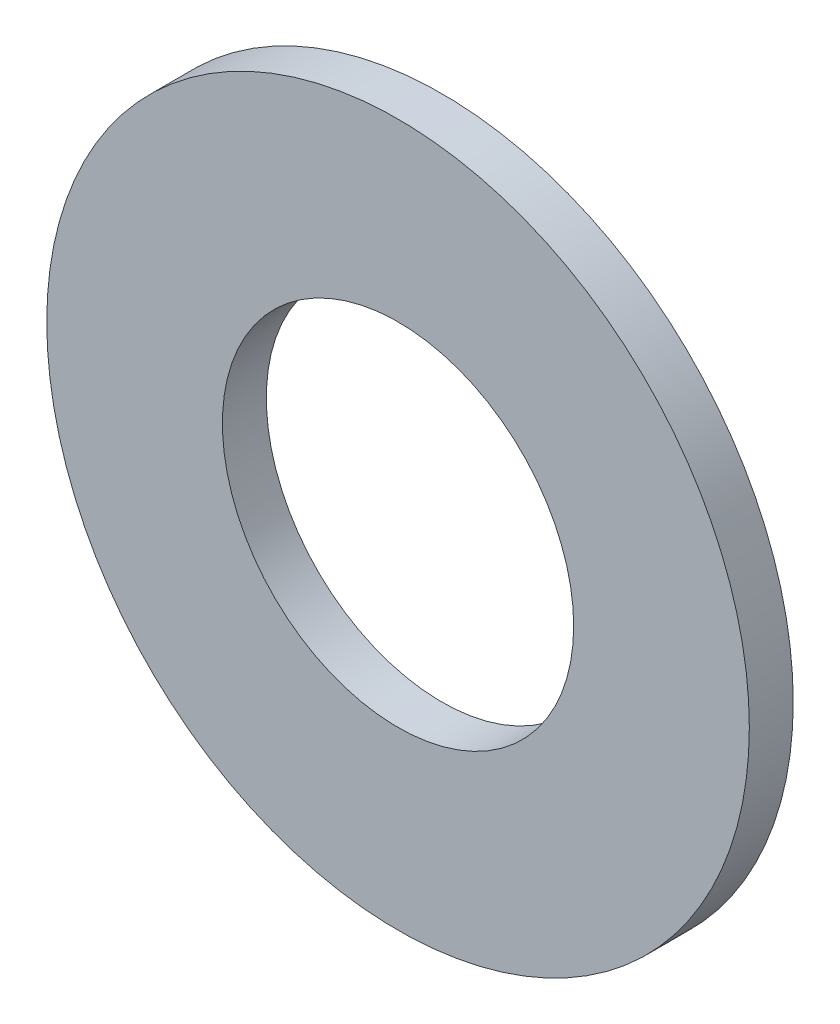
ISO-10303-21;
HEADER;
FILE_DESCRIPTION(('STEP AP214'),'2;1');
FILE_NAME('part.step','',(''),(''),'','','');
FILE_SCHEMA(('AUTOMOTIVE_DESIGN { 1 0 10303 214 1 1 1 1 }'));
ENDSEC;
DATA;
#1=APPLICATION_CONTEXT('core data for automotive mechanical design processes');
#2=APPLICATION_PROTOCOL_DEFINITION('international standard','automotive_design',2000,#1);
#3=PRODUCT_CONTEXT('',#1,'mechanical');
#4=PRODUCT('Part','Part','',(#3));
#5=PRODUCT_RELATED_PRODUCT_CATEGORY('part','',(#4));
#6=PRODUCT_DEFINITION_FORMATION('','',#4);
#7=PRODUCT_DEFINITION_CONTEXT('part definition',#1,'design');
#8=PRODUCT_DEFINITION('design','',#6,#7);
#9=PRODUCT_DEFINITION_SHAPE('','',#8);
#10=(LENGTH_UNIT() NAMED_UNIT(*) SI_UNIT(.MILLI.,.METRE.));
#11=(NAMED_UNIT(*) PLANE_ANGLE_UNIT() SI_UNIT($,.RADIAN.));
#12=(NAMED_UNIT(*) SI_UNIT($,.STERADIAN.) SOLID_ANGLE_UNIT());
#13=UNCERTAINTY_MEASURE_WITH_UNIT(LENGTH_MEASURE(1.E-05),#10,'distance_accuracy_value','');
#14=(GEOMETRIC_REPRESENTATION_CONTEXT(3) GLOBAL_UNCERTAINTY_ASSIGNED_CONTEXT((#13)) GLOBAL_UNIT_ASSIGNED_CONTEXT((#10,
#11,#12)) REPRESENTATION_CONTEXT('',''));
#15=CARTESIAN_POINT('',(0.,0.,0.));
#16=DIRECTION('',(0.,0.,1.));
#17=DIRECTION('',(1.,0.,0.));
#18=AXIS2_PLACEMENT_3D('',#15,#16,#17);
#19=CARTESIAN_POINT('',(0.,0.,1.5));
#20=DIRECTION('',(0.,0.,1.));
#21=DIRECTION('',(1.,0.,0.));
#22=AXIS2_PLACEMENT_3D('',#19,#20,#21);
#23=PLANE('',#22);
#24=CARTESIAN_POINT('',(0.,0.,1.5));
#25=DIRECTION('',(0.,0.,1.));
#26=DIRECTION('',(1.,0.,0.));
#27=AXIS2_PLACEMENT_3D('',#24,#25,#26);
#28=CIRCLE('',#27,12.);
#29=CARTESIAN_POINT('',(12.,0.,1.5));
#30=VERTEX_POINT('',#29);
#31=EDGE_CURVE('E10',#30,#30,#28,.T.);
#32=ORIENTED_EDGE('',*,*,#31,.T.);
#33=EDGE_LOOP('',(#32));
#34=FACE_BOUND('',#33,.T.);
#35=CARTESIAN_POINT('',(0.,0.,1.5));
#36=DIRECTION('',(0.,0.,1.));
#37=DIRECTION('',(1.,0.,0.));
#38=AXIS2_PLACEMENT_3D('',#35,#36,#37);
#39=CIRCLE('',#38,6.);
#40=CARTESIAN_POINT('',(6.,0.,1.5));
#41=VERTEX_POINT('',#40);
#42=EDGE_CURVE('E50',#41,#41,#39,.T.);
#43=ORIENTED_EDGE('',*,*,#42,.F.);
#44=EDGE_LOOP('',(#43));
#45=FACE_BOUND('',#44,.T.);
#46=ADVANCED_FACE('F37',(#34,#45),#23,.T.);
#47=CARTESIAN_POINT('',(0.,0.,0.));
#48=DIRECTION('',(0.,0.,1.));
#49=DIRECTION('',(1.,0.,0.));
#50=AXIS2_PLACEMENT_3D('',#47,#48,#49);
#51=PLANE('',#50);
#52=CARTESIAN_POINT('',(0.,0.,0.));
#53=DIRECTION('',(0.,0.,1.));
#54=DIRECTION('',(1.,0.,0.));
#55=AXIS2_PLACEMENT_3D('',#52,#53,#54);
#56=CIRCLE('',#55,12.);
#57=CARTESIAN_POINT('',(12.,0.,0.));
#58=VERTEX_POINT('',#57);
#59=EDGE_CURVE('E41',#58,#58,#56,.T.);
#60=ORIENTED_EDGE('',*,*,#59,.F.);
#61=EDGE_LOOP('',(#60));
#62=FACE_BOUND('',#61,.T.);
#63=CARTESIAN_POINT('',(0.,0.,0.));
#64=DIRECTION('',(0.,0.,1.));
#65=DIRECTION('',(1.,0.,0.));
#66=AXIS2_PLACEMENT_3D('',#63,#64,#65);
#67=CIRCLE('',#66,6.);
#68=CARTESIAN_POINT('',(6.,0.,0.));
#69=VERTEX_POINT('',#68);
#70=EDGE_CURVE('E52',#69,#69,#67,.T.);
#71=ORIENTED_EDGE('',*,*,#70,.T.);
#72=EDGE_LOOP('',(#71));
#73=FACE_BOUND('',#72,.T.);
#74=ADVANCED_FACE('F64',(#62,#73),#51,.F.);
#75=CARTESIAN_POINT('',(0.,0.,1.5));
#76=DIRECTION('',(0.,0.,-1.));
#77=DIRECTION('',(-1.,0.,0.));
#78=AXIS2_PLACEMENT_3D('',#75,#76,#77);
#79=CYLINDRICAL_SURFACE('',#78,12.);
#80=ORIENTED_EDGE('',*,*,#31,.F.);
#81=EDGE_LOOP('',(#80));
#82=FACE_BOUND('',#81,.T.);
#83=ORIENTED_EDGE('',*,*,#59,.T.);
#84=EDGE_LOOP('',(#83));
#85=FACE_BOUND('',#84,.T.);
#86=ADVANCED_FACE('F39',(#82,#85),#79,.T.);
#87=CARTESIAN_POINT('',(0.,0.,1.5));
#88=DIRECTION('',(0.,0.,-1.));
#89=DIRECTION('',(-1.,0.,0.));
#90=AXIS2_PLACEMENT_3D('',#87,#88,#89);
#91=CYLINDRICAL_SURFACE('',#90,6.);
#92=ORIENTED_EDGE('',*,*,#42,.T.);
#93=EDGE_LOOP('',(#92));
#94=FACE_BOUND('',#93,.T.);
#95=ORIENTED_EDGE('',*,*,#70,.F.);
#96=EDGE_LOOP('',(#95));
#97=FACE_BOUND('',#96,.T.);
#98=ADVANCED_FACE('F60',(#94,#97),#91,.F.);
#99=CLOSED_SHELL('',(#46,#74,#86,#98));
#100=MANIFOLD_SOLID_BREP('B2',#99);
#101=ADVANCED_BREP_SHAPE_REPRESENTATION('',(#18,#100),#14);
#102=SHAPE_DEFINITION_REPRESENTATION(#9,#101);
ENDSEC;
END-ISO-10303-21;
